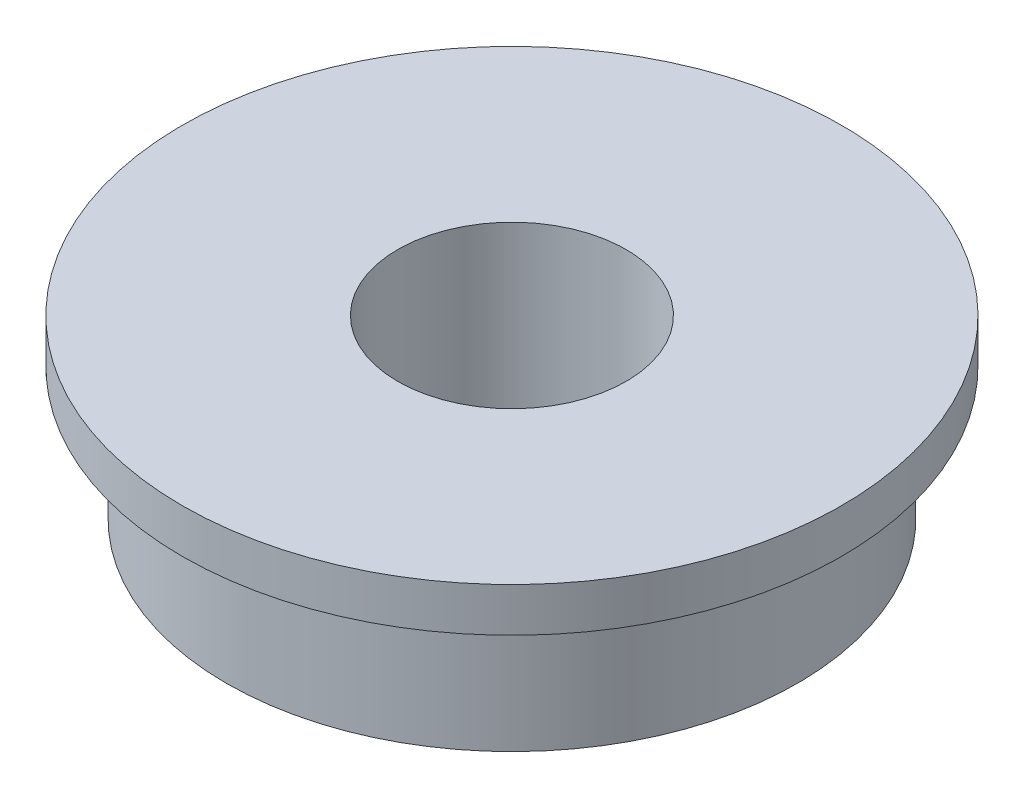
ISO-10303-21;
HEADER;
FILE_DESCRIPTION(('STEP AP214'),'2;1');
FILE_NAME('part.step','',(''),(''),'','','');
FILE_SCHEMA(('AUTOMOTIVE_DESIGN { 1 0 10303 214 1 1 1 1 }'));
ENDSEC;
DATA;
#1=APPLICATION_CONTEXT('core data for automotive mechanical design processes');
#2=APPLICATION_PROTOCOL_DEFINITION('international standard','automotive_design',2000,#1);
#3=PRODUCT_CONTEXT('',#1,'mechanical');
#4=PRODUCT('Part','Part','',(#3));
#5=PRODUCT_RELATED_PRODUCT_CATEGORY('part','',(#4));
#6=PRODUCT_DEFINITION_FORMATION('','',#4);
#7=PRODUCT_DEFINITION_CONTEXT('part definition',#1,'design');
#8=PRODUCT_DEFINITION('design','',#6,#7);
#9=PRODUCT_DEFINITION_SHAPE('','',#8);
#10=(LENGTH_UNIT() NAMED_UNIT(*) SI_UNIT(.MILLI.,.METRE.));
#11=(NAMED_UNIT(*) PLANE_ANGLE_UNIT() SI_UNIT($,.RADIAN.));
#12=(NAMED_UNIT(*) SI_UNIT($,.STERADIAN.) SOLID_ANGLE_UNIT());
#13=UNCERTAINTY_MEASURE_WITH_UNIT(LENGTH_MEASURE(1.E-05),#10,'distance_accuracy_value','');
#14=(GEOMETRIC_REPRESENTATION_CONTEXT(3) GLOBAL_UNCERTAINTY_ASSIGNED_CONTEXT((#13)) GLOBAL_UNIT_ASSIGNED_CONTEXT((#10,
#11,#12)) REPRESENTATION_CONTEXT('',''));
#15=CARTESIAN_POINT('',(0.,0.,0.));
#16=DIRECTION('',(0.,0.,1.));
#17=DIRECTION('',(1.,0.,0.));
#18=AXIS2_PLACEMENT_3D('',#15,#16,#17);
#19=CARTESIAN_POINT('',(0.,4.,0.));
#20=DIRECTION('',(0.,-1.,0.));
#21=DIRECTION('',(0.,0.,-1.));
#22=AXIS2_PLACEMENT_3D('',#19,#20,#21);
#23=CYLINDRICAL_SURFACE('',#22,6.5);
#24=CARTESIAN_POINT('',(0.,0.,0.));
#25=DIRECTION('',(0.,1.,0.));
#26=DIRECTION('',(0.,0.,1.));
#27=AXIS2_PLACEMENT_3D('',#24,#25,#26);
#28=CIRCLE('',#27,6.5);
#29=CARTESIAN_POINT('',(0.,0.,6.5));
#30=VERTEX_POINT('',#29);
#31=EDGE_CURVE('E35',#30,#30,#28,.T.);
#32=ORIENTED_EDGE('',*,*,#31,.T.);
#33=EDGE_LOOP('',(#32));
#34=FACE_BOUND('',#33,.T.);
#35=CARTESIAN_POINT('',(0.,3.,0.));
#36=DIRECTION('',(0.,1.,0.));
#37=DIRECTION('',(0.,0.,1.));
#38=AXIS2_PLACEMENT_3D('',#35,#36,#37);
#39=CIRCLE('',#38,6.5);
#40=CARTESIAN_POINT('',(0.,3.,6.5));
#41=VERTEX_POINT('',#40);
#42=EDGE_CURVE('E10',#41,#41,#39,.T.);
#43=ORIENTED_EDGE('',*,*,#42,.F.);
#44=EDGE_LOOP('',(#43));
#45=FACE_BOUND('',#44,.T.);
#46=ADVANCED_FACE('F32',(#34,#45),#23,.T.);
#47=CARTESIAN_POINT('',(0.,4.,0.));
#48=DIRECTION('',(0.,1.,0.));
#49=DIRECTION('',(0.,0.,1.));
#50=AXIS2_PLACEMENT_3D('',#47,#48,#49);
#51=PLANE('',#50);
#52=CARTESIAN_POINT('',(0.,4.,0.));
#53=DIRECTION('',(0.,1.,0.));
#54=DIRECTION('',(0.,0.,1.));
#55=AXIS2_PLACEMENT_3D('',#52,#53,#54);
#56=CIRCLE('',#55,2.6);
#57=CARTESIAN_POINT('',(0.,4.,2.6));
#58=VERTEX_POINT('',#57);
#59=EDGE_CURVE('E43',#58,#58,#56,.T.);
#60=ORIENTED_EDGE('',*,*,#59,.F.);
#61=EDGE_LOOP('',(#60));
#62=FACE_BOUND('',#61,.T.);
#63=CARTESIAN_POINT('',(0.,4.,0.));
#64=DIRECTION('',(0.,1.,0.));
#65=DIRECTION('',(0.,0.,1.));
#66=AXIS2_PLACEMENT_3D('',#63,#64,#65);
#67=CIRCLE('',#66,7.5);
#68=CARTESIAN_POINT('',(0.,4.,7.5));
#69=VERTEX_POINT('',#68);
#70=EDGE_CURVE('E46',#69,#69,#67,.T.);
#71=ORIENTED_EDGE('',*,*,#70,.T.);
#72=EDGE_LOOP('',(#71));
#73=FACE_BOUND('',#72,.T.);
#74=ADVANCED_FACE('F60',(#62,#73),#51,.T.);
#75=CARTESIAN_POINT('',(0.,0.,0.));
#76=DIRECTION('',(0.,1.,0.));
#77=DIRECTION('',(0.,0.,1.));
#78=AXIS2_PLACEMENT_3D('',#75,#76,#77);
#79=PLANE('',#78);
#80=ORIENTED_EDGE('',*,*,#31,.F.);
#81=EDGE_LOOP('',(#80));
#82=FACE_BOUND('',#81,.T.);
#83=CARTESIAN_POINT('',(0.,0.,0.));
#84=DIRECTION('',(0.,1.,0.));
#85=DIRECTION('',(0.,0.,1.));
#86=AXIS2_PLACEMENT_3D('',#83,#84,#85);
#87=CIRCLE('',#86,2.6);
#88=CARTESIAN_POINT('',(0.,0.,2.6));
#89=VERTEX_POINT('',#88);
#90=EDGE_CURVE('E49',#89,#89,#87,.T.);
#91=ORIENTED_EDGE('',*,*,#90,.T.);
#92=EDGE_LOOP('',(#91));
#93=FACE_BOUND('',#92,.T.);
#94=ADVANCED_FACE('F78',(#82,#93),#79,.F.);
#95=CARTESIAN_POINT('',(0.,4.,0.));
#96=DIRECTION('',(0.,-1.,0.));
#97=DIRECTION('',(0.,0.,-1.));
#98=AXIS2_PLACEMENT_3D('',#95,#96,#97);
#99=CYLINDRICAL_SURFACE('',#98,2.6);
#100=ORIENTED_EDGE('',*,*,#59,.T.);
#101=EDGE_LOOP('',(#100));
#102=FACE_BOUND('',#101,.T.);
#103=ORIENTED_EDGE('',*,*,#90,.F.);
#104=EDGE_LOOP('',(#103));
#105=FACE_BOUND('',#104,.T.);
#106=ADVANCED_FACE('F69',(#102,#105),#99,.F.);
#107=CARTESIAN_POINT('',(0.,3.,0.));
#108=DIRECTION('',(0.,1.,0.));
#109=DIRECTION('',(0.,0.,1.));
#110=AXIS2_PLACEMENT_3D('',#107,#108,#109);
#111=PLANE('',#110);
#112=CARTESIAN_POINT('',(0.,3.,0.));
#113=DIRECTION('',(0.,1.,0.));
#114=DIRECTION('',(0.,0.,1.));
#115=AXIS2_PLACEMENT_3D('',#112,#113,#114);
#116=CIRCLE('',#115,7.5);
#117=CARTESIAN_POINT('',(0.,3.,7.5));
#118=VERTEX_POINT('',#117);
#119=EDGE_CURVE('E51',#118,#118,#116,.T.);
#120=ORIENTED_EDGE('',*,*,#119,.F.);
#121=EDGE_LOOP('',(#120));
#122=FACE_BOUND('',#121,.T.);
#123=ORIENTED_EDGE('',*,*,#42,.T.);
#124=EDGE_LOOP('',(#123));
#125=FACE_BOUND('',#124,.T.);
#126=ADVANCED_FACE('F64',(#122,#125),#111,.F.);
#127=CARTESIAN_POINT('',(0.,3.,0.));
#128=DIRECTION('',(0.,1.,0.));
#129=DIRECTION('',(0.,0.,1.));
#130=AXIS2_PLACEMENT_3D('',#127,#128,#129);
#131=CYLINDRICAL_SURFACE('',#130,7.5);
#132=ORIENTED_EDGE('',*,*,#119,.T.);
#133=EDGE_LOOP('',(#132));
#134=FACE_BOUND('',#133,.T.);
#135=ORIENTED_EDGE('',*,*,#70,.F.);
#136=EDGE_LOOP('',(#135));
#137=FACE_BOUND('',#136,.T.);
#138=ADVANCED_FACE('F62',(#134,#137),#131,.T.);
#139=CLOSED_SHELL('',(#46,#74,#94,#106,#126,#138));
#140=MANIFOLD_SOLID_BREP('B2',#139);
#141=ADVANCED_BREP_SHAPE_REPRESENTATION('',(#18,#140),#14);
#142=SHAPE_DEFINITION_REPRESENTATION(#9,#141);
ENDSEC;
END-ISO-10303-21;
